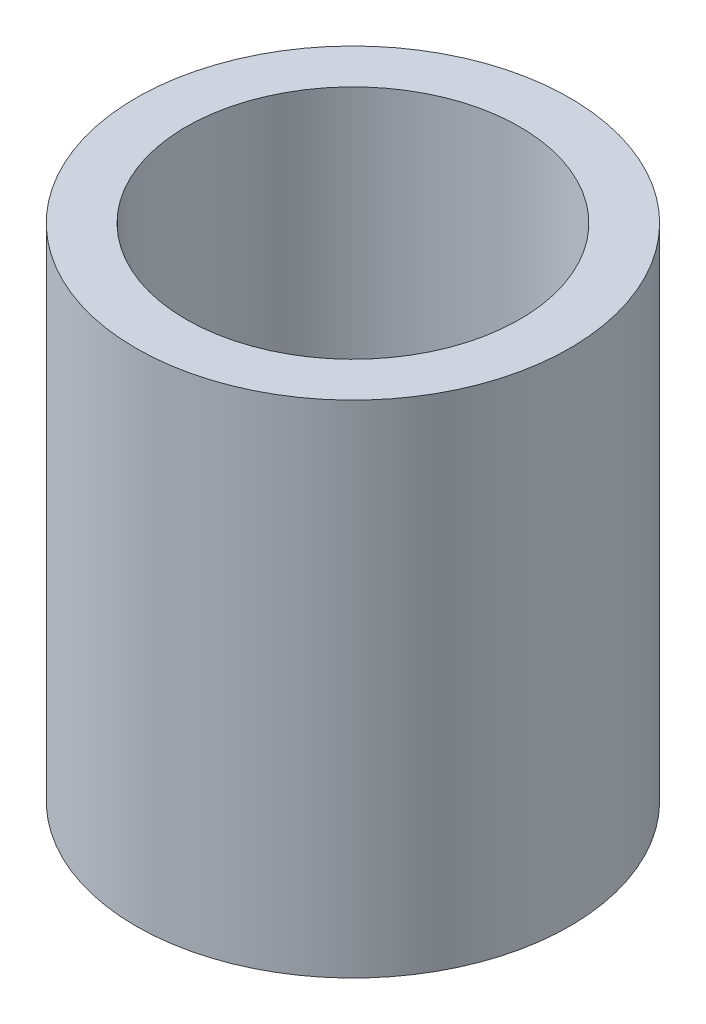
ISO-10303-21;
HEADER;
FILE_DESCRIPTION(('STEP AP214'),'2;1');
FILE_NAME('part.step','',(''),(''),'','','');
FILE_SCHEMA(('AUTOMOTIVE_DESIGN { 1 0 10303 214 1 1 1 1 }'));
ENDSEC;
DATA;
#1=APPLICATION_CONTEXT('core data for automotive mechanical design processes');
#2=APPLICATION_PROTOCOL_DEFINITION('international standard','automotive_design',2000,#1);
#3=PRODUCT_CONTEXT('',#1,'mechanical');
#4=PRODUCT('Part','Part','',(#3));
#5=PRODUCT_RELATED_PRODUCT_CATEGORY('part','',(#4));
#6=PRODUCT_DEFINITION_FORMATION('','',#4);
#7=PRODUCT_DEFINITION_CONTEXT('part definition',#1,'design');
#8=PRODUCT_DEFINITION('design','',#6,#7);
#9=PRODUCT_DEFINITION_SHAPE('','',#8);
#10=(LENGTH_UNIT() NAMED_UNIT(*) SI_UNIT(.MILLI.,.METRE.));
#11=(NAMED_UNIT(*) PLANE_ANGLE_UNIT() SI_UNIT($,.RADIAN.));
#12=(NAMED_UNIT(*) SI_UNIT($,.STERADIAN.) SOLID_ANGLE_UNIT());
#13=UNCERTAINTY_MEASURE_WITH_UNIT(LENGTH_MEASURE(1.E-05),#10,'distance_accuracy_value','');
#14=(GEOMETRIC_REPRESENTATION_CONTEXT(3) GLOBAL_UNCERTAINTY_ASSIGNED_CONTEXT((#13)) GLOBAL_UNIT_ASSIGNED_CONTEXT((#10,
#11,#12)) REPRESENTATION_CONTEXT('',''));
#15=CARTESIAN_POINT('',(0.,0.,0.));
#16=DIRECTION('',(0.,0.,1.));
#17=DIRECTION('',(1.,0.,0.));
#18=AXIS2_PLACEMENT_3D('',#15,#16,#17);
#19=CARTESIAN_POINT('',(0.,6.,0.));
#20=DIRECTION('',(0.,1.,0.));
#21=DIRECTION('',(0.,0.,1.));
#22=AXIS2_PLACEMENT_3D('',#19,#20,#21);
#23=PLANE('',#22);
#24=CARTESIAN_POINT('',(0.,6.,0.));
#25=DIRECTION('',(0.,1.,0.));
#26=DIRECTION('',(0.,0.,1.));
#27=AXIS2_PLACEMENT_3D('',#24,#25,#26);
#28=CIRCLE('',#27,2.6);
#29=CARTESIAN_POINT('',(0.,6.,2.6));
#30=VERTEX_POINT('',#29);
#31=EDGE_CURVE('E10',#30,#30,#28,.T.);
#32=ORIENTED_EDGE('',*,*,#31,.T.);
#33=EDGE_LOOP('',(#32));
#34=FACE_BOUND('',#33,.T.);
#35=CARTESIAN_POINT('',(0.,6.,0.));
#36=DIRECTION('',(0.,1.,0.));
#37=DIRECTION('',(0.,0.,1.));
#38=AXIS2_PLACEMENT_3D('',#35,#36,#37);
#39=CIRCLE('',#38,2.);
#40=CARTESIAN_POINT('',(0.,6.,2.));
#41=VERTEX_POINT('',#40);
#42=EDGE_CURVE('E46',#41,#41,#39,.T.);
#43=ORIENTED_EDGE('',*,*,#42,.F.);
#44=EDGE_LOOP('',(#43));
#45=FACE_BOUND('',#44,.T.);
#46=ADVANCED_FACE('F35',(#34,#45),#23,.T.);
#47=CARTESIAN_POINT('',(0.,0.,0.));
#48=DIRECTION('',(0.,1.,0.));
#49=DIRECTION('',(0.,0.,1.));
#50=AXIS2_PLACEMENT_3D('',#47,#48,#49);
#51=PLANE('',#50);
#52=CARTESIAN_POINT('',(0.,0.,0.));
#53=DIRECTION('',(0.,1.,0.));
#54=DIRECTION('',(0.,0.,1.));
#55=AXIS2_PLACEMENT_3D('',#52,#53,#54);
#56=CIRCLE('',#55,2.6);
#57=CARTESIAN_POINT('',(0.,0.,2.6));
#58=VERTEX_POINT('',#57);
#59=EDGE_CURVE('E39',#58,#58,#56,.T.);
#60=ORIENTED_EDGE('',*,*,#59,.F.);
#61=EDGE_LOOP('',(#60));
#62=FACE_BOUND('',#61,.T.);
#63=CARTESIAN_POINT('',(0.,0.,0.));
#64=DIRECTION('',(0.,1.,0.));
#65=DIRECTION('',(0.,0.,1.));
#66=AXIS2_PLACEMENT_3D('',#63,#64,#65);
#67=CIRCLE('',#66,2.);
#68=CARTESIAN_POINT('',(0.,0.,2.));
#69=VERTEX_POINT('',#68);
#70=EDGE_CURVE('E48',#69,#69,#67,.T.);
#71=ORIENTED_EDGE('',*,*,#70,.T.);
#72=EDGE_LOOP('',(#71));
#73=FACE_BOUND('',#72,.T.);
#74=ADVANCED_FACE('F58',(#62,#73),#51,.F.);
#75=CARTESIAN_POINT('',(0.,6.,0.));
#76=DIRECTION('',(0.,-1.,0.));
#77=DIRECTION('',(0.,0.,-1.));
#78=AXIS2_PLACEMENT_3D('',#75,#76,#77);
#79=CYLINDRICAL_SURFACE('',#78,2.6);
#80=ORIENTED_EDGE('',*,*,#31,.F.);
#81=EDGE_LOOP('',(#80));
#82=FACE_BOUND('',#81,.T.);
#83=ORIENTED_EDGE('',*,*,#59,.T.);
#84=EDGE_LOOP('',(#83));
#85=FACE_BOUND('',#84,.T.);
#86=ADVANCED_FACE('F37',(#82,#85),#79,.T.);
#87=CARTESIAN_POINT('',(0.,6.,0.));
#88=DIRECTION('',(0.,-1.,0.));
#89=DIRECTION('',(0.,0.,-1.));
#90=AXIS2_PLACEMENT_3D('',#87,#88,#89);
#91=CYLINDRICAL_SURFACE('',#90,2.);
#92=ORIENTED_EDGE('',*,*,#42,.T.);
#93=EDGE_LOOP('',(#92));
#94=FACE_BOUND('',#93,.T.);
#95=ORIENTED_EDGE('',*,*,#70,.F.);
#96=EDGE_LOOP('',(#95));
#97=FACE_BOUND('',#96,.T.);
#98=ADVANCED_FACE('F54',(#94,#97),#91,.F.);
#99=CLOSED_SHELL('',(#46,#74,#86,#98));
#100=MANIFOLD_SOLID_BREP('B2',#99);
#101=ADVANCED_BREP_SHAPE_REPRESENTATION('',(#18,#100),#14);
#102=SHAPE_DEFINITION_REPRESENTATION(#9,#101);
ENDSEC;
END-ISO-10303-21;
